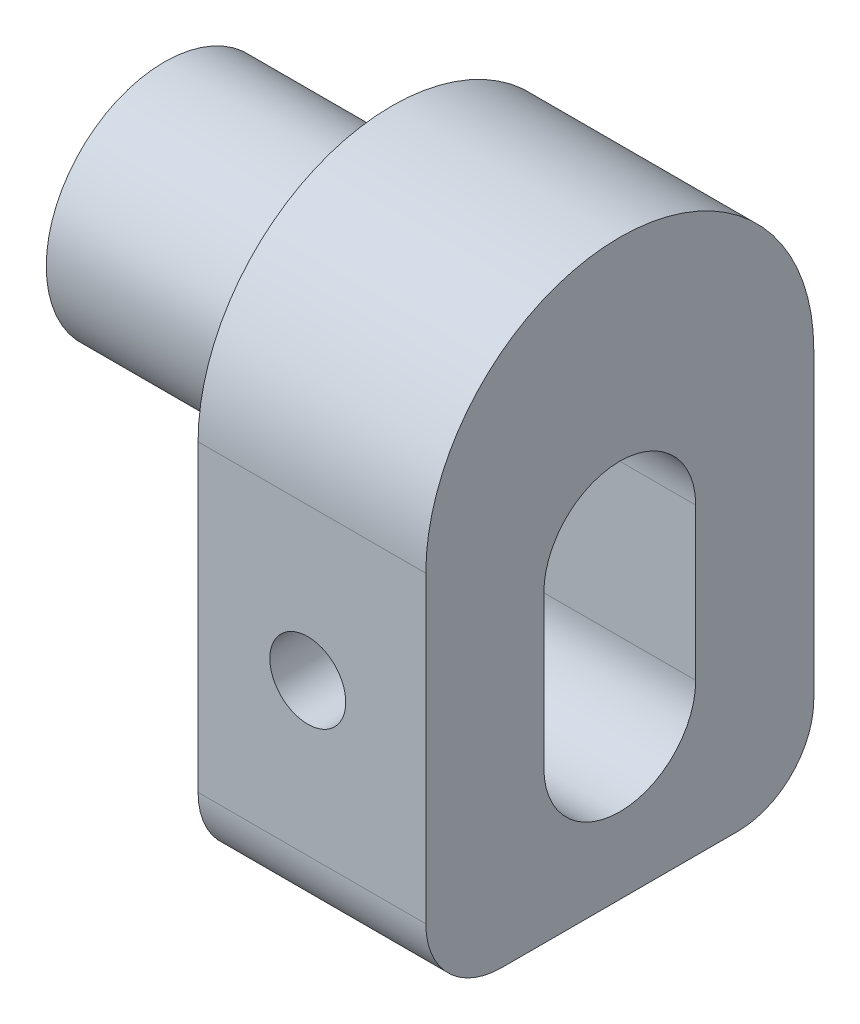
ISO-10303-21;
HEADER;
FILE_DESCRIPTION(('STEP AP214'),'2;1');
FILE_NAME('part.step','',(''),(''),'','','');
FILE_SCHEMA(('AUTOMOTIVE_DESIGN { 1 0 10303 214 1 1 1 1 }'));
ENDSEC;
DATA;
#1=APPLICATION_CONTEXT('core data for automotive mechanical design processes');
#2=APPLICATION_PROTOCOL_DEFINITION('international standard','automotive_design',2000,#1);
#3=PRODUCT_CONTEXT('',#1,'mechanical');
#4=PRODUCT('Part','Part','',(#3));
#5=PRODUCT_RELATED_PRODUCT_CATEGORY('part','',(#4));
#6=PRODUCT_DEFINITION_FORMATION('','',#4);
#7=PRODUCT_DEFINITION_CONTEXT('part definition',#1,'design');
#8=PRODUCT_DEFINITION('design','',#6,#7);
#9=PRODUCT_DEFINITION_SHAPE('','',#8);
#10=(LENGTH_UNIT() NAMED_UNIT(*) SI_UNIT(.MILLI.,.METRE.));
#11=(NAMED_UNIT(*) PLANE_ANGLE_UNIT() SI_UNIT($,.RADIAN.));
#12=(NAMED_UNIT(*) SI_UNIT($,.STERADIAN.) SOLID_ANGLE_UNIT());
#13=UNCERTAINTY_MEASURE_WITH_UNIT(LENGTH_MEASURE(1.E-05),#10,'distance_accuracy_value','');
#14=(GEOMETRIC_REPRESENTATION_CONTEXT(3) GLOBAL_UNCERTAINTY_ASSIGNED_CONTEXT((#13)) GLOBAL_UNIT_ASSIGNED_CONTEXT((#10,
#11,#12)) REPRESENTATION_CONTEXT('',''));
#15=CARTESIAN_POINT('',(0.,0.,0.));
#16=DIRECTION('',(0.,0.,1.));
#17=DIRECTION('',(1.,0.,0.));
#18=AXIS2_PLACEMENT_3D('',#15,#16,#17);
#19=CARTESIAN_POINT('',(7.62,0.,0.));
#20=DIRECTION('',(-1.,0.,0.));
#21=DIRECTION('',(0.,0.,1.));
#22=AXIS2_PLACEMENT_3D('',#19,#20,#21);
#23=CYLINDRICAL_SURFACE('',#22,3.95);
#24=CARTESIAN_POINT('',(6.35,0.,0.));
#25=DIRECTION('',(-1.,0.,0.));
#26=DIRECTION('',(0.,0.,1.));
#27=AXIS2_PLACEMENT_3D('',#24,#25,#26);
#28=CIRCLE('',#27,3.95);
#29=CARTESIAN_POINT('',(6.35,0.,3.95));
#30=VERTEX_POINT('',#29);
#31=EDGE_CURVE('E162',#30,#30,#28,.T.);
#32=ORIENTED_EDGE('',*,*,#31,.T.);
#33=EDGE_LOOP('',(#32));
#34=FACE_BOUND('',#33,.T.);
#35=CARTESIAN_POINT('',(0.,0.,0.));
#36=DIRECTION('',(1.,0.,0.));
#37=DIRECTION('',(0.,0.,-1.));
#38=AXIS2_PLACEMENT_3D('',#35,#36,#37);
#39=CIRCLE('',#38,3.95);
#40=CARTESIAN_POINT('',(0.,0.,-3.95));
#41=VERTEX_POINT('',#40);
#42=EDGE_CURVE('E209',#41,#41,#39,.T.);
#43=ORIENTED_EDGE('',*,*,#42,.T.);
#44=EDGE_LOOP('',(#43));
#45=FACE_BOUND('',#44,.T.);
#46=ADVANCED_FACE('F39',(#34,#45),#23,.T.);
#47=CARTESIAN_POINT('',(0.,0.,0.));
#48=DIRECTION('',(1.,0.,0.));
#49=DIRECTION('',(0.,0.,-1.));
#50=AXIS2_PLACEMENT_3D('',#47,#48,#49);
#51=PLANE('',#50);
#52=ORIENTED_EDGE('',*,*,#42,.F.);
#53=EDGE_LOOP('',(#52));
#54=FACE_BOUND('',#53,.T.);
#55=ADVANCED_FACE('F292',(#54),#51,.F.);
#56=CARTESIAN_POINT('',(6.35,0.,0.));
#57=DIRECTION('',(1.,0.,0.));
#58=DIRECTION('',(0.,0.,-1.));
#59=AXIS2_PLACEMENT_3D('',#56,#57,#58);
#60=CYLINDRICAL_SURFACE('',#59,4.445);
#61=CARTESIAN_POINT('',(6.35,0.,0.));
#62=DIRECTION('',(-1.,0.,0.));
#63=DIRECTION('',(0.,0.,1.));
#64=AXIS2_PLACEMENT_3D('',#61,#62,#63);
#65=CIRCLE('',#64,4.445);
#66=CARTESIAN_POINT('',(6.35,0.,4.445));
#67=VERTEX_POINT('',#66);
#68=EDGE_CURVE('E159',#67,#67,#65,.T.);
#69=ORIENTED_EDGE('',*,*,#68,.F.);
#70=EDGE_LOOP('',(#69));
#71=FACE_BOUND('',#70,.T.);
#72=CARTESIAN_POINT('',(7.62,0.,0.));
#73=DIRECTION('',(-1.,0.,0.));
#74=DIRECTION('',(0.,0.,1.));
#75=AXIS2_PLACEMENT_3D('',#72,#73,#74);
#76=CIRCLE('',#75,4.445);
#77=CARTESIAN_POINT('',(7.62,-3.64779393825596,-2.5400048));
#78=VERTEX_POINT('',#77);
#79=CARTESIAN_POINT('',(7.62,-3.64780062283795,2.5399952));
#80=VERTEX_POINT('',#79);
#81=EDGE_CURVE('E130',#78,#80,#76,.T.);
#82=ORIENTED_EDGE('',*,*,#81,.T.);
#83=EDGE_CURVE('E150',#80,#78,#76,.T.);
#84=ORIENTED_EDGE('',*,*,#83,.T.);
#85=EDGE_LOOP('',(#82,#84));
#86=FACE_BOUND('',#85,.T.);
#87=ADVANCED_FACE('F157',(#71,#86),#60,.T.);
#88=CARTESIAN_POINT('',(6.35,0.,0.));
#89=DIRECTION('',(-1.,0.,0.));
#90=DIRECTION('',(0.,0.,1.));
#91=AXIS2_PLACEMENT_3D('',#88,#89,#90);
#92=PLANE('',#91);
#93=ORIENTED_EDGE('',*,*,#31,.F.);
#94=EDGE_LOOP('',(#93));
#95=FACE_BOUND('',#94,.T.);
#96=ORIENTED_EDGE('',*,*,#68,.T.);
#97=EDGE_LOOP('',(#96));
#98=FACE_BOUND('',#97,.T.);
#99=ADVANCED_FACE('F321',(#95,#98),#92,.T.);
#100=CARTESIAN_POINT('',(-15.5475743227469,0.,6.49));
#101=DIRECTION('',(0.,0.,1.));
#102=DIRECTION('',(1.,0.,0.));
#103=AXIS2_PLACEMENT_3D('',#100,#101,#102);
#104=PLANE('',#103);
#105=CARTESIAN_POINT('',(11.2909741860108,-5.08,6.49));
#106=DIRECTION('',(0.,0.,-1.));
#107=DIRECTION('',(-1.,0.,0.));
#108=AXIS2_PLACEMENT_3D('',#105,#106,#107);
#109=CIRCLE('',#108,1.27);
#110=CARTESIAN_POINT('',(10.0209741860108,-5.08,6.49));
#111=VERTEX_POINT('',#110);
#112=EDGE_CURVE('E165',#111,#111,#109,.T.);
#113=ORIENTED_EDGE('',*,*,#112,.T.);
#114=EDGE_LOOP('',(#113));
#115=FACE_BOUND('',#114,.T.);
#116=DIRECTION('',(0.,-1.,0.));
#117=VECTOR('',#116,1.);
#118=CARTESIAN_POINT('',(7.62,0.,6.49));
#119=LINE('',#118,#117);
#120=CARTESIAN_POINT('',(7.62,0.,6.49));
#121=VERTEX_POINT('',#120);
#122=CARTESIAN_POINT('',(7.62,-10.16,6.49));
#123=VERTEX_POINT('',#122);
#124=EDGE_CURVE('E222',#121,#123,#119,.T.);
#125=ORIENTED_EDGE('',*,*,#124,.T.);
#126=DIRECTION('',(1.,0.,0.));
#127=VECTOR('',#126,1.);
#128=CARTESIAN_POINT('',(-15.5475743227469,-10.16,6.49));
#129=LINE('',#128,#127);
#130=CARTESIAN_POINT('',(15.24,-10.16,6.49));
#131=VERTEX_POINT('',#130);
#132=EDGE_CURVE('E11',#123,#131,#129,.T.);
#133=ORIENTED_EDGE('',*,*,#132,.T.);
#134=DIRECTION('',(0.,-1.,0.));
#135=VECTOR('',#134,1.);
#136=CARTESIAN_POINT('',(15.24,0.,6.49));
#137=LINE('',#136,#135);
#138=CARTESIAN_POINT('',(15.24,0.,6.49));
#139=VERTEX_POINT('',#138);
#140=EDGE_CURVE('E214',#139,#131,#137,.T.);
#141=ORIENTED_EDGE('',*,*,#140,.F.);
#142=DIRECTION('',(1.,0.,0.));
#143=VECTOR('',#142,1.);
#144=CARTESIAN_POINT('',(-15.5475743227469,0.,6.49));
#145=LINE('',#144,#143);
#146=EDGE_CURVE('E229',#121,#139,#145,.T.);
#147=ORIENTED_EDGE('',*,*,#146,.F.);
#148=EDGE_LOOP('',(#125,#133,#141,#147));
#149=FACE_BOUND('',#148,.T.);
#150=ADVANCED_FACE('F284',(#115,#149),#104,.T.);
#151=CARTESIAN_POINT('',(-15.5475743227469,-12.7,6.49));
#152=DIRECTION('',(0.,-1.,0.));
#153=DIRECTION('',(0.,0.,-1.));
#154=AXIS2_PLACEMENT_3D('',#151,#152,#153);
#155=PLANE('',#154);
#156=DIRECTION('',(0.,0.,-1.));
#157=VECTOR('',#156,1.);
#158=CARTESIAN_POINT('',(7.62,-12.7,6.49));
#159=LINE('',#158,#157);
#160=CARTESIAN_POINT('',(7.62,-12.7,3.95));
#161=VERTEX_POINT('',#160);
#162=CARTESIAN_POINT('',(7.62,-12.7,-3.95));
#163=VERTEX_POINT('',#162);
#164=EDGE_CURVE('E225',#161,#163,#159,.T.);
#165=ORIENTED_EDGE('',*,*,#164,.T.);
#166=DIRECTION('',(1.,0.,0.));
#167=VECTOR('',#166,1.);
#168=CARTESIAN_POINT('',(-15.5475743227469,-12.7,-3.95));
#169=LINE('',#168,#167);
#170=CARTESIAN_POINT('',(15.24,-12.7,-3.95));
#171=VERTEX_POINT('',#170);
#172=EDGE_CURVE('E251',#163,#171,#169,.T.);
#173=ORIENTED_EDGE('',*,*,#172,.T.);
#174=DIRECTION('',(0.,0.,-1.));
#175=VECTOR('',#174,1.);
#176=CARTESIAN_POINT('',(15.24,-12.7,6.49));
#177=LINE('',#176,#175);
#178=CARTESIAN_POINT('',(15.24,-12.7,3.95));
#179=VERTEX_POINT('',#178);
#180=EDGE_CURVE('E210',#179,#171,#177,.T.);
#181=ORIENTED_EDGE('',*,*,#180,.F.);
#182=DIRECTION('',(1.,0.,0.));
#183=VECTOR('',#182,1.);
#184=CARTESIAN_POINT('',(-15.5475743227469,-12.7,3.95));
#185=LINE('',#184,#183);
#186=EDGE_CURVE('E245',#179,#161,#185,.F.);
#187=ORIENTED_EDGE('',*,*,#186,.T.);
#188=EDGE_LOOP('',(#165,#173,#181,#187));
#189=FACE_BOUND('',#188,.T.);
#190=ADVANCED_FACE('F270',(#189),#155,.T.);
#191=CARTESIAN_POINT('',(-15.5475743227469,-12.7,-6.49));
#192=DIRECTION('',(0.,0.,-1.));
#193=DIRECTION('',(0.,1.,0.));
#194=AXIS2_PLACEMENT_3D('',#191,#192,#193);
#195=PLANE('',#194);
#196=DIRECTION('',(0.,1.,0.));
#197=VECTOR('',#196,1.);
#198=CARTESIAN_POINT('',(15.24,-12.7,-6.49));
#199=LINE('',#198,#197);
#200=CARTESIAN_POINT('',(15.24,-10.16,-6.49));
#201=VERTEX_POINT('',#200);
#202=CARTESIAN_POINT('',(15.24,0.,-6.49));
#203=VERTEX_POINT('',#202);
#204=EDGE_CURVE('E206',#201,#203,#199,.T.);
#205=ORIENTED_EDGE('',*,*,#204,.F.);
#206=DIRECTION('',(1.,0.,0.));
#207=VECTOR('',#206,1.);
#208=CARTESIAN_POINT('',(-15.5475743227469,-10.16,-6.49));
#209=LINE('',#208,#207);
#210=CARTESIAN_POINT('',(7.62,-10.16,-6.49));
#211=VERTEX_POINT('',#210);
#212=EDGE_CURVE('E63',#201,#211,#209,.F.);
#213=ORIENTED_EDGE('',*,*,#212,.T.);
#214=DIRECTION('',(0.,1.,0.));
#215=VECTOR('',#214,1.);
#216=CARTESIAN_POINT('',(7.62,-12.7,-6.49));
#217=LINE('',#216,#215);
#218=CARTESIAN_POINT('',(7.62,0.,-6.49));
#219=VERTEX_POINT('',#218);
#220=EDGE_CURVE('E230',#211,#219,#217,.T.);
#221=ORIENTED_EDGE('',*,*,#220,.T.);
#222=DIRECTION('',(1.,0.,0.));
#223=VECTOR('',#222,1.);
#224=CARTESIAN_POINT('',(-15.5475743227469,0.,-6.49));
#225=LINE('',#224,#223);
#226=EDGE_CURVE('E233',#219,#203,#225,.T.);
#227=ORIENTED_EDGE('',*,*,#226,.T.);
#228=EDGE_LOOP('',(#205,#213,#221,#227));
#229=FACE_BOUND('',#228,.T.);
#230=ADVANCED_FACE('F276',(#229),#195,.T.);
#231=CARTESIAN_POINT('',(-15.5475743227469,0.,0.));
#232=DIRECTION('',(1.,0.,0.));
#233=DIRECTION('',(0.,0.,-1.));
#234=AXIS2_PLACEMENT_3D('',#231,#232,#233);
#235=CYLINDRICAL_SURFACE('',#234,6.49);
#236=ORIENTED_EDGE('',*,*,#226,.F.);
#237=CARTESIAN_POINT('',(7.62,0.,0.));
#238=DIRECTION('',(-1.,0.,0.));
#239=DIRECTION('',(0.,0.,1.));
#240=AXIS2_PLACEMENT_3D('',#237,#238,#239);
#241=CIRCLE('',#240,6.49);
#242=EDGE_CURVE('E198',#219,#121,#241,.F.);
#243=ORIENTED_EDGE('',*,*,#242,.T.);
#244=ORIENTED_EDGE('',*,*,#146,.T.);
#245=CARTESIAN_POINT('',(15.24,0.,0.));
#246=DIRECTION('',(1.,0.,0.));
#247=DIRECTION('',(0.,0.,-1.));
#248=AXIS2_PLACEMENT_3D('',#245,#246,#247);
#249=CIRCLE('',#248,6.49);
#250=EDGE_CURVE('E218',#203,#139,#249,.T.);
#251=ORIENTED_EDGE('',*,*,#250,.F.);
#252=EDGE_LOOP('',(#236,#243,#244,#251));
#253=FACE_BOUND('',#252,.T.);
#254=ADVANCED_FACE('F280',(#253),#235,.T.);
#255=CARTESIAN_POINT('',(7.62,-2.54,-4.79999999946842E-06));
#256=DIRECTION('',(1.,0.,0.));
#257=DIRECTION('',(0.,0.,-1.));
#258=AXIS2_PLACEMENT_3D('',#255,#256,#257);
#259=CYLINDRICAL_SURFACE('',#258,2.54);
#260=CARTESIAN_POINT('',(15.24,-2.54,-4.79999999946842E-06));
#261=DIRECTION('',(1.,0.,0.));
#262=DIRECTION('',(0.,0.,1.));
#263=AXIS2_PLACEMENT_3D('',#260,#261,#262);
#264=CIRCLE('',#263,2.54);
#265=CARTESIAN_POINT('',(15.24,-2.54,-2.5400048));
#266=VERTEX_POINT('',#265);
#267=CARTESIAN_POINT('',(15.24,-2.54,2.5399952));
#268=VERTEX_POINT('',#267);
#269=EDGE_CURVE('E169',#266,#268,#264,.T.);
#270=ORIENTED_EDGE('',*,*,#269,.T.);
#271=DIRECTION('',(1.,0.,0.));
#272=VECTOR('',#271,1.);
#273=CARTESIAN_POINT('',(7.62,-2.54,2.5399952));
#274=LINE('',#273,#272);
#275=CARTESIAN_POINT('',(7.62,-2.54,2.5399952));
#276=VERTEX_POINT('',#275);
#277=EDGE_CURVE('E182',#276,#268,#274,.T.);
#278=ORIENTED_EDGE('',*,*,#277,.F.);
#279=CARTESIAN_POINT('',(7.62,-2.54,-4.79999999946842E-06));
#280=DIRECTION('',(1.,0.,0.));
#281=DIRECTION('',(0.,0.,1.));
#282=AXIS2_PLACEMENT_3D('',#279,#280,#281);
#283=CIRCLE('',#282,2.54);
#284=CARTESIAN_POINT('',(7.62,-2.54,-2.5400048));
#285=VERTEX_POINT('',#284);
#286=EDGE_CURVE('E132',#285,#276,#283,.T.);
#287=ORIENTED_EDGE('',*,*,#286,.F.);
#288=DIRECTION('',(1.,0.,0.));
#289=VECTOR('',#288,1.);
#290=CARTESIAN_POINT('',(7.62,-2.54,-2.5400048));
#291=LINE('',#290,#289);
#292=EDGE_CURVE('E195',#285,#266,#291,.T.);
#293=ORIENTED_EDGE('',*,*,#292,.T.);
#294=EDGE_LOOP('',(#270,#278,#287,#293));
#295=FACE_BOUND('',#294,.T.);
#296=ADVANCED_FACE('F314',(#295),#259,.F.);
#297=CARTESIAN_POINT('',(7.62,-7.62,-4.79999999946842E-06));
#298=DIRECTION('',(1.,0.,0.));
#299=DIRECTION('',(0.,0.,-1.));
#300=AXIS2_PLACEMENT_3D('',#297,#298,#299);
#301=CYLINDRICAL_SURFACE('',#300,2.54);
#302=CARTESIAN_POINT('',(15.24,-7.62,-4.79999999946842E-06));
#303=DIRECTION('',(1.,0.,0.));
#304=DIRECTION('',(0.,0.,-1.));
#305=AXIS2_PLACEMENT_3D('',#302,#303,#304);
#306=CIRCLE('',#305,2.54);
#307=CARTESIAN_POINT('',(15.24,-7.62,2.5399952));
#308=VERTEX_POINT('',#307);
#309=CARTESIAN_POINT('',(15.24,-7.62,-2.5400048));
#310=VERTEX_POINT('',#309);
#311=EDGE_CURVE('E188',#308,#310,#306,.T.);
#312=ORIENTED_EDGE('',*,*,#311,.T.);
#313=DIRECTION('',(1.,0.,0.));
#314=VECTOR('',#313,1.);
#315=CARTESIAN_POINT('',(7.62,-7.62,-2.5400048));
#316=LINE('',#315,#314);
#317=CARTESIAN_POINT('',(7.62,-7.62,-2.5400048));
#318=VERTEX_POINT('',#317);
#319=EDGE_CURVE('E199',#318,#310,#316,.T.);
#320=ORIENTED_EDGE('',*,*,#319,.F.);
#321=CARTESIAN_POINT('',(7.62,-7.62,-4.79999999946842E-06));
#322=DIRECTION('',(1.,0.,0.));
#323=DIRECTION('',(0.,0.,-1.));
#324=AXIS2_PLACEMENT_3D('',#321,#322,#323);
#325=CIRCLE('',#324,2.54);
#326=CARTESIAN_POINT('',(7.62,-7.62,2.5399952));
#327=VERTEX_POINT('',#326);
#328=EDGE_CURVE('E136',#327,#318,#325,.T.);
#329=ORIENTED_EDGE('',*,*,#328,.F.);
#330=DIRECTION('',(1.,0.,0.));
#331=VECTOR('',#330,1.);
#332=CARTESIAN_POINT('',(7.62,-7.62,2.5399952));
#333=LINE('',#332,#331);
#334=EDGE_CURVE('E143',#327,#308,#333,.T.);
#335=ORIENTED_EDGE('',*,*,#334,.T.);
#336=EDGE_LOOP('',(#312,#320,#329,#335));
#337=FACE_BOUND('',#336,.T.);
#338=ADVANCED_FACE('F310',(#337),#301,.F.);
#339=CARTESIAN_POINT('',(15.24,0.,0.));
#340=DIRECTION('',(-1.,0.,0.));
#341=DIRECTION('',(0.,0.,1.));
#342=AXIS2_PLACEMENT_3D('',#339,#340,#341);
#343=PLANE('',#342);
#344=DIRECTION('',(0.,-1.,0.));
#345=VECTOR('',#344,1.);
#346=CARTESIAN_POINT('',(15.24,-2.54,2.5399952));
#347=LINE('',#346,#345);
#348=EDGE_CURVE('E185',#268,#308,#347,.T.);
#349=ORIENTED_EDGE('',*,*,#348,.F.);
#350=ORIENTED_EDGE('',*,*,#269,.F.);
#351=DIRECTION('',(0.,1.,0.));
#352=VECTOR('',#351,1.);
#353=CARTESIAN_POINT('',(15.24,-2.54,-2.5400048));
#354=LINE('',#353,#352);
#355=EDGE_CURVE('E175',#310,#266,#354,.T.);
#356=ORIENTED_EDGE('',*,*,#355,.F.);
#357=ORIENTED_EDGE('',*,*,#311,.F.);
#358=EDGE_LOOP('',(#349,#350,#356,#357));
#359=FACE_BOUND('',#358,.T.);
#360=ORIENTED_EDGE('',*,*,#180,.T.);
#361=CARTESIAN_POINT('',(15.24,-10.16,-3.95));
#362=DIRECTION('',(-1.,0.,0.));
#363=DIRECTION('',(0.,0.,1.));
#364=AXIS2_PLACEMENT_3D('',#361,#362,#363);
#365=CIRCLE('',#364,2.54);
#366=EDGE_CURVE('E258',#171,#201,#365,.F.);
#367=ORIENTED_EDGE('',*,*,#366,.T.);
#368=ORIENTED_EDGE('',*,*,#204,.T.);
#369=ORIENTED_EDGE('',*,*,#250,.T.);
#370=ORIENTED_EDGE('',*,*,#140,.T.);
#371=CARTESIAN_POINT('',(15.24,-10.16,3.95));
#372=DIRECTION('',(-1.,0.,0.));
#373=DIRECTION('',(0.,0.,1.));
#374=AXIS2_PLACEMENT_3D('',#371,#372,#373);
#375=CIRCLE('',#374,2.54);
#376=EDGE_CURVE('E255',#131,#179,#375,.F.);
#377=ORIENTED_EDGE('',*,*,#376,.T.);
#378=EDGE_LOOP('',(#360,#367,#368,#369,#370,#377));
#379=FACE_BOUND('',#378,.T.);
#380=ADVANCED_FACE('F275',(#359,#379),#343,.F.);
#381=CARTESIAN_POINT('',(11.2909741860108,-5.08,6.49));
#382=DIRECTION('',(0.,0.,-1.));
#383=DIRECTION('',(-1.,0.,0.));
#384=AXIS2_PLACEMENT_3D('',#381,#382,#383);
#385=CYLINDRICAL_SURFACE('',#384,1.27);
#386=ORIENTED_EDGE('',*,*,#112,.F.);
#387=EDGE_LOOP('',(#386));
#388=FACE_BOUND('',#387,.T.);
#389=CARTESIAN_POINT('',(11.2909741860108,-5.08,2.5399952));
#390=DIRECTION('',(0.,0.,-1.));
#391=DIRECTION('',(-1.,0.,0.));
#392=AXIS2_PLACEMENT_3D('',#389,#390,#391);
#393=CIRCLE('',#392,1.27);
#394=CARTESIAN_POINT('',(10.0209741860108,-5.08,2.5399952));
#395=VERTEX_POINT('',#394);
#396=EDGE_CURVE('E170',#395,#395,#393,.T.);
#397=ORIENTED_EDGE('',*,*,#396,.T.);
#398=EDGE_LOOP('',(#397));
#399=FACE_BOUND('',#398,.T.);
#400=ADVANCED_FACE('F309',(#388,#399),#385,.F.);
#401=CARTESIAN_POINT('',(7.62,-2.54,2.5399952));
#402=DIRECTION('',(0.,0.,1.));
#403=DIRECTION('',(1.,0.,0.));
#404=AXIS2_PLACEMENT_3D('',#401,#402,#403);
#405=PLANE('',#404);
#406=ORIENTED_EDGE('',*,*,#396,.F.);
#407=EDGE_LOOP('',(#406));
#408=FACE_BOUND('',#407,.T.);
#409=ORIENTED_EDGE('',*,*,#348,.T.);
#410=ORIENTED_EDGE('',*,*,#334,.F.);
#411=DIRECTION('',(0.,-1.,0.));
#412=VECTOR('',#411,1.);
#413=CARTESIAN_POINT('',(7.62,-2.54,2.5399952));
#414=LINE('',#413,#412);
#415=EDGE_CURVE('E137',#80,#327,#414,.T.);
#416=ORIENTED_EDGE('',*,*,#415,.F.);
#417=EDGE_CURVE('E126',#276,#80,#414,.T.);
#418=ORIENTED_EDGE('',*,*,#417,.F.);
#419=ORIENTED_EDGE('',*,*,#277,.T.);
#420=EDGE_LOOP('',(#409,#410,#416,#418,#419));
#421=FACE_BOUND('',#420,.T.);
#422=ADVANCED_FACE('F142',(#408,#421),#405,.F.);
#423=CARTESIAN_POINT('',(7.62,-2.54,-2.5400048));
#424=DIRECTION('',(0.,0.,-1.));
#425=DIRECTION('',(0.,1.,0.));
#426=AXIS2_PLACEMENT_3D('',#423,#424,#425);
#427=PLANE('',#426);
#428=ORIENTED_EDGE('',*,*,#355,.T.);
#429=ORIENTED_EDGE('',*,*,#292,.F.);
#430=DIRECTION('',(0.,1.,0.));
#431=VECTOR('',#430,1.);
#432=CARTESIAN_POINT('',(7.62,-2.54,-2.5400048));
#433=LINE('',#432,#431);
#434=EDGE_CURVE('E179',#78,#285,#433,.T.);
#435=ORIENTED_EDGE('',*,*,#434,.F.);
#436=EDGE_CURVE('E153',#318,#78,#433,.T.);
#437=ORIENTED_EDGE('',*,*,#436,.F.);
#438=ORIENTED_EDGE('',*,*,#319,.T.);
#439=EDGE_LOOP('',(#428,#429,#435,#437,#438));
#440=FACE_BOUND('',#439,.T.);
#441=ADVANCED_FACE('F306',(#440),#427,.F.);
#442=CARTESIAN_POINT('',(7.62,0.,0.));
#443=DIRECTION('',(-1.,0.,0.));
#444=DIRECTION('',(0.,0.,1.));
#445=AXIS2_PLACEMENT_3D('',#442,#443,#444);
#446=PLANE('',#445);
#447=ORIENTED_EDGE('',*,*,#436,.T.);
#448=ORIENTED_EDGE('',*,*,#83,.F.);
#449=ORIENTED_EDGE('',*,*,#415,.T.);
#450=ORIENTED_EDGE('',*,*,#328,.T.);
#451=EDGE_LOOP('',(#447,#448,#449,#450));
#452=FACE_BOUND('',#451,.T.);
#453=ORIENTED_EDGE('',*,*,#220,.F.);
#454=CARTESIAN_POINT('',(7.62,-10.16,-3.95));
#455=DIRECTION('',(-1.,0.,0.));
#456=DIRECTION('',(0.,0.,1.));
#457=AXIS2_PLACEMENT_3D('',#454,#455,#456);
#458=CIRCLE('',#457,2.54);
#459=EDGE_CURVE('E48',#211,#163,#458,.T.);
#460=ORIENTED_EDGE('',*,*,#459,.T.);
#461=ORIENTED_EDGE('',*,*,#164,.F.);
#462=CARTESIAN_POINT('',(7.62,-10.16,3.95));
#463=DIRECTION('',(-1.,0.,0.));
#464=DIRECTION('',(0.,0.,1.));
#465=AXIS2_PLACEMENT_3D('',#462,#463,#464);
#466=CIRCLE('',#465,2.54);
#467=EDGE_CURVE('E55',#161,#123,#466,.T.);
#468=ORIENTED_EDGE('',*,*,#467,.T.);
#469=ORIENTED_EDGE('',*,*,#124,.F.);
#470=ORIENTED_EDGE('',*,*,#242,.F.);
#471=EDGE_LOOP('',(#453,#460,#461,#468,#469,#470));
#472=FACE_BOUND('',#471,.T.);
#473=ADVANCED_FACE('F151',(#452,#472),#446,.T.);
#474=CARTESIAN_POINT('',(7.62,-2.54,-4.79999999946842E-06));
#475=DIRECTION('',(-1.,0.,0.));
#476=DIRECTION('',(0.,0.,1.));
#477=AXIS2_PLACEMENT_3D('',#474,#475,#476);
#478=PLANE('',#477);
#479=ORIENTED_EDGE('',*,*,#434,.T.);
#480=ORIENTED_EDGE('',*,*,#286,.T.);
#481=ORIENTED_EDGE('',*,*,#417,.T.);
#482=ORIENTED_EDGE('',*,*,#81,.F.);
#483=EDGE_LOOP('',(#479,#480,#481,#482));
#484=FACE_BOUND('',#483,.T.);
#485=ADVANCED_FACE('F128',(#484),#478,.F.);
#486=CARTESIAN_POINT('',(-15.5475743227469,-10.16,-3.95));
#487=DIRECTION('',(1.,0.,0.));
#488=DIRECTION('',(0.,0.,-1.));
#489=AXIS2_PLACEMENT_3D('',#486,#487,#488);
#490=CYLINDRICAL_SURFACE('',#489,2.54);
#491=ORIENTED_EDGE('',*,*,#459,.F.);
#492=ORIENTED_EDGE('',*,*,#212,.F.);
#493=ORIENTED_EDGE('',*,*,#366,.F.);
#494=ORIENTED_EDGE('',*,*,#172,.F.);
#495=EDGE_LOOP('',(#491,#492,#493,#494));
#496=FACE_BOUND('',#495,.T.);
#497=ADVANCED_FACE('F273',(#496),#490,.T.);
#498=CARTESIAN_POINT('',(-15.5475743227469,-10.16,3.95));
#499=DIRECTION('',(1.,0.,0.));
#500=DIRECTION('',(0.,0.,-1.));
#501=AXIS2_PLACEMENT_3D('',#498,#499,#500);
#502=CYLINDRICAL_SURFACE('',#501,2.54);
#503=ORIENTED_EDGE('',*,*,#467,.F.);
#504=ORIENTED_EDGE('',*,*,#186,.F.);
#505=ORIENTED_EDGE('',*,*,#376,.F.);
#506=ORIENTED_EDGE('',*,*,#132,.F.);
#507=EDGE_LOOP('',(#503,#504,#505,#506));
#508=FACE_BOUND('',#507,.T.);
#509=ADVANCED_FACE('F41',(#508),#502,.T.);
#510=CLOSED_SHELL('',(#46,#55,#87,#99,#150,#190,#230,#254,#296,#338,#380,#400,#422,#441,#473,
#485,#497,#509));
#511=MANIFOLD_SOLID_BREP('B2',#510);
#512=ADVANCED_BREP_SHAPE_REPRESENTATION('',(#18,#511),#14);
#513=SHAPE_DEFINITION_REPRESENTATION(#9,#512);
ENDSEC;
END-ISO-10303-21;
